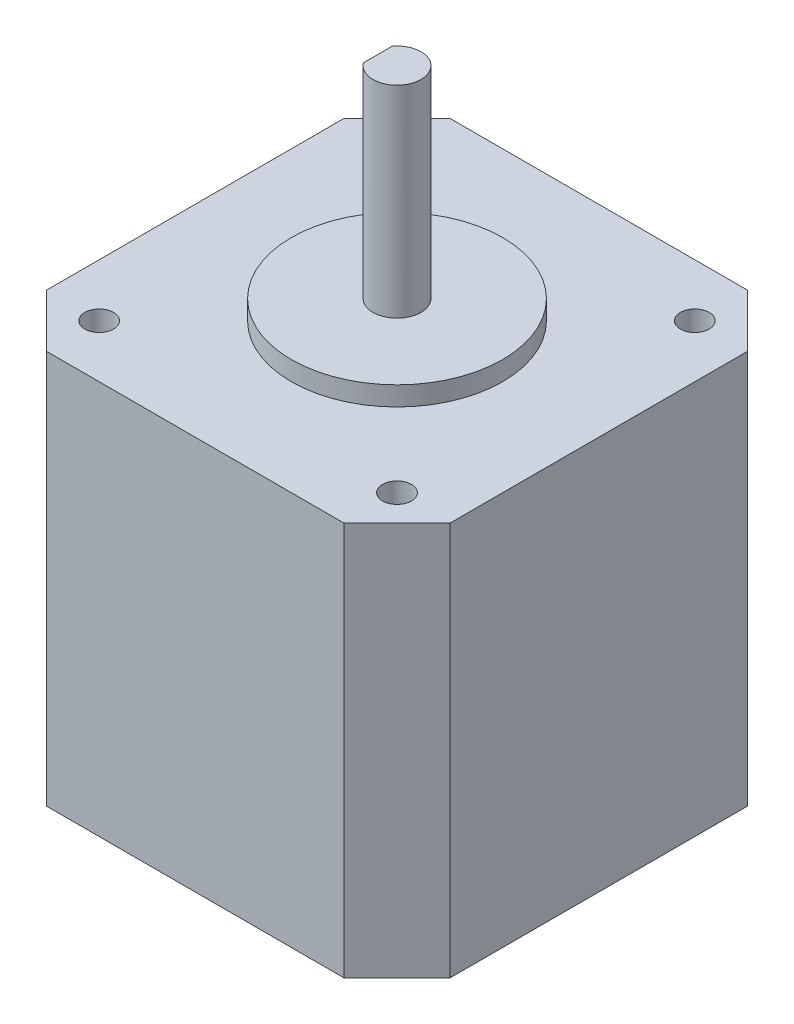
ISO-10303-21;
HEADER;
FILE_DESCRIPTION(('STEP AP214'),'2;1');
FILE_NAME('part.step','',(''),(''),'','','');
FILE_SCHEMA(('AUTOMOTIVE_DESIGN { 1 0 10303 214 1 1 1 1 }'));
ENDSEC;
DATA;
#1=APPLICATION_CONTEXT('core data for automotive mechanical design processes');
#2=APPLICATION_PROTOCOL_DEFINITION('international standard','automotive_design',2000,#1);
#3=PRODUCT_CONTEXT('',#1,'mechanical');
#4=PRODUCT('Part','Part','',(#3));
#5=PRODUCT_RELATED_PRODUCT_CATEGORY('part','',(#4));
#6=PRODUCT_DEFINITION_FORMATION('','',#4);
#7=PRODUCT_DEFINITION_CONTEXT('part definition',#1,'design');
#8=PRODUCT_DEFINITION('design','',#6,#7);
#9=PRODUCT_DEFINITION_SHAPE('','',#8);
#10=(LENGTH_UNIT() NAMED_UNIT(*) SI_UNIT(.MILLI.,.METRE.));
#11=(NAMED_UNIT(*) PLANE_ANGLE_UNIT() SI_UNIT($,.RADIAN.));
#12=(NAMED_UNIT(*) SI_UNIT($,.STERADIAN.) SOLID_ANGLE_UNIT());
#13=UNCERTAINTY_MEASURE_WITH_UNIT(LENGTH_MEASURE(1.E-05),#10,'distance_accuracy_value','');
#14=(GEOMETRIC_REPRESENTATION_CONTEXT(3) GLOBAL_UNCERTAINTY_ASSIGNED_CONTEXT((#13)) GLOBAL_UNIT_ASSIGNED_CONTEXT((#10,
#11,#12)) REPRESENTATION_CONTEXT('',''));
#15=CARTESIAN_POINT('',(0.,0.,0.));
#16=DIRECTION('',(0.,0.,1.));
#17=DIRECTION('',(1.,0.,0.));
#18=AXIS2_PLACEMENT_3D('',#15,#16,#17);
#19=CARTESIAN_POINT('',(-20.9999999999999,11.5,15.5000000000004));
#20=DIRECTION('',(0.707106781186548,0.,-0.707106781186548));
#21=DIRECTION('',(-0.707106781186548,0.,-0.707106781186548));
#22=AXIS2_PLACEMENT_3D('',#19,#20,#21);
#23=PLANE('',#22);
#24=DIRECTION('',(0.,-1.,0.));
#25=VECTOR('',#24,1.);
#26=CARTESIAN_POINT('',(-20.9999999999999,11.5,15.5000000000004));
#27=LINE('',#26,#25);
#28=CARTESIAN_POINT('',(-20.9999999999999,19.5,15.5000000000004));
#29=VERTEX_POINT('',#28);
#30=CARTESIAN_POINT('',(-20.9999999999999,-21.5,15.5000000000004));
#31=VERTEX_POINT('',#30);
#32=EDGE_CURVE('E210',#29,#31,#27,.T.);
#33=ORIENTED_EDGE('',*,*,#32,.T.);
#34=DIRECTION('',(-0.707106781186548,0.,-0.707106781186548));
#35=VECTOR('',#34,1.);
#36=CARTESIAN_POINT('',(-18.2500000000002,-21.5,18.2500000000002));
#37=LINE('',#36,#35);
#38=CARTESIAN_POINT('',(-15.5000000000001,-21.5,21.0000000000002));
#39=VERTEX_POINT('',#38);
#40=EDGE_CURVE('E190',#39,#31,#37,.T.);
#41=ORIENTED_EDGE('',*,*,#40,.F.);
#42=DIRECTION('',(0.,-1.,0.));
#43=VECTOR('',#42,1.);
#44=CARTESIAN_POINT('',(-15.5000000000001,11.5,21.0000000000002));
#45=LINE('',#44,#43);
#46=CARTESIAN_POINT('',(-15.5000000000001,19.5,21.0000000000002));
#47=VERTEX_POINT('',#46);
#48=EDGE_CURVE('E37',#47,#39,#45,.T.);
#49=ORIENTED_EDGE('',*,*,#48,.F.);
#50=DIRECTION('',(0.707106781186547,0.,0.707106781186547));
#51=VECTOR('',#50,1.);
#52=CARTESIAN_POINT('',(-20.9999999999999,19.5,15.5000000000004));
#53=LINE('',#52,#51);
#54=EDGE_CURVE('E161',#29,#47,#53,.T.);
#55=ORIENTED_EDGE('',*,*,#54,.F.);
#56=EDGE_LOOP('',(#33,#41,#49,#55));
#57=FACE_BOUND('',#56,.T.);
#58=ADVANCED_FACE('F34',(#57),#23,.F.);
#59=CARTESIAN_POINT('',(-15.5000000000001,11.5,21.0000000000002));
#60=DIRECTION('',(0.,0.,-1.));
#61=DIRECTION('',(-1.,0.,0.));
#62=AXIS2_PLACEMENT_3D('',#59,#60,#61);
#63=PLANE('',#62);
#64=ORIENTED_EDGE('',*,*,#48,.T.);
#65=DIRECTION('',(-1.,0.,0.));
#66=VECTOR('',#65,1.);
#67=CARTESIAN_POINT('',(0.,-21.5,21.0000000000002));
#68=LINE('',#67,#66);
#69=CARTESIAN_POINT('',(15.5000000000003,-21.5,21.0000000000002));
#70=VERTEX_POINT('',#69);
#71=EDGE_CURVE('E187',#70,#39,#68,.T.);
#72=ORIENTED_EDGE('',*,*,#71,.F.);
#73=DIRECTION('',(0.,-1.,0.));
#74=VECTOR('',#73,1.);
#75=CARTESIAN_POINT('',(15.5000000000003,11.5,21.0000000000002));
#76=LINE('',#75,#74);
#77=CARTESIAN_POINT('',(15.5000000000003,19.5,21.0000000000002));
#78=VERTEX_POINT('',#77);
#79=EDGE_CURVE('E57',#78,#70,#76,.T.);
#80=ORIENTED_EDGE('',*,*,#79,.F.);
#81=DIRECTION('',(1.,0.,0.));
#82=VECTOR('',#81,1.);
#83=CARTESIAN_POINT('',(-15.5000000000001,19.5,21.0000000000002));
#84=LINE('',#83,#82);
#85=EDGE_CURVE('E166',#47,#78,#84,.T.);
#86=ORIENTED_EDGE('',*,*,#85,.F.);
#87=EDGE_LOOP('',(#64,#72,#80,#86));
#88=FACE_BOUND('',#87,.T.);
#89=ADVANCED_FACE('F225',(#88),#63,.F.);
#90=CARTESIAN_POINT('',(15.5000000000003,11.5,21.0000000000002));
#91=DIRECTION('',(-0.707106781186555,0.,-0.70710678118654));
#92=DIRECTION('',(-0.70710678118654,0.,0.707106781186555));
#93=AXIS2_PLACEMENT_3D('',#90,#91,#92);
#94=PLANE('',#93);
#95=ORIENTED_EDGE('',*,*,#79,.T.);
#96=DIRECTION('',(-0.70710678118654,0.,0.707106781186555));
#97=VECTOR('',#96,1.);
#98=CARTESIAN_POINT('',(18.2500000000004,-21.5,18.2500000000001));
#99=LINE('',#98,#97);
#100=CARTESIAN_POINT('',(20.9999999999997,-21.5,15.5000000000007));
#101=VERTEX_POINT('',#100);
#102=EDGE_CURVE('E208',#101,#70,#99,.T.);
#103=ORIENTED_EDGE('',*,*,#102,.F.);
#104=DIRECTION('',(0.,-1.,0.));
#105=VECTOR('',#104,1.);
#106=CARTESIAN_POINT('',(20.9999999999997,11.5,15.5000000000007));
#107=LINE('',#106,#105);
#108=CARTESIAN_POINT('',(20.9999999999997,19.5,15.5000000000007));
#109=VERTEX_POINT('',#108);
#110=EDGE_CURVE('E220',#109,#101,#107,.T.);
#111=ORIENTED_EDGE('',*,*,#110,.F.);
#112=DIRECTION('',(0.70710678118654,0.,-0.707106781186555));
#113=VECTOR('',#112,1.);
#114=CARTESIAN_POINT('',(15.5000000000003,19.5,21.0000000000002));
#115=LINE('',#114,#113);
#116=EDGE_CURVE('E169',#78,#109,#115,.T.);
#117=ORIENTED_EDGE('',*,*,#116,.F.);
#118=EDGE_LOOP('',(#95,#103,#111,#117));
#119=FACE_BOUND('',#118,.T.);
#120=ADVANCED_FACE('F232',(#119),#94,.F.);
#121=CARTESIAN_POINT('',(20.9999999999997,11.5,-15.5000000000003));
#122=DIRECTION('',(-1.,0.,0.));
#123=DIRECTION('',(0.,0.,1.));
#124=AXIS2_PLACEMENT_3D('',#121,#122,#123);
#125=PLANE('',#124);
#126=ORIENTED_EDGE('',*,*,#110,.T.);
#127=DIRECTION('',(0.,0.,1.));
#128=VECTOR('',#127,1.);
#129=CARTESIAN_POINT('',(20.9999999999997,-21.5,0.));
#130=LINE('',#129,#128);
#131=CARTESIAN_POINT('',(20.9999999999997,-21.5,-15.5000000000003));
#132=VERTEX_POINT('',#131);
#133=EDGE_CURVE('E205',#132,#101,#130,.T.);
#134=ORIENTED_EDGE('',*,*,#133,.F.);
#135=DIRECTION('',(0.,-1.,0.));
#136=VECTOR('',#135,1.);
#137=CARTESIAN_POINT('',(20.9999999999997,11.5,-15.5000000000003));
#138=LINE('',#137,#136);
#139=CARTESIAN_POINT('',(20.9999999999997,19.5,-15.5000000000003));
#140=VERTEX_POINT('',#139);
#141=EDGE_CURVE('E218',#140,#132,#138,.T.);
#142=ORIENTED_EDGE('',*,*,#141,.F.);
#143=DIRECTION('',(0.,0.,-1.));
#144=VECTOR('',#143,1.);
#145=CARTESIAN_POINT('',(20.9999999999997,19.5,-15.5000000000003));
#146=LINE('',#145,#144);
#147=EDGE_CURVE('E172',#109,#140,#146,.T.);
#148=ORIENTED_EDGE('',*,*,#147,.F.);
#149=EDGE_LOOP('',(#126,#134,#142,#148));
#150=FACE_BOUND('',#149,.T.);
#151=ADVANCED_FACE('F239',(#150),#125,.F.);
#152=CARTESIAN_POINT('',(15.5000000000003,11.5,-20.9999999999998));
#153=DIRECTION('',(-0.707106781186555,0.,0.70710678118654));
#154=DIRECTION('',(0.70710678118654,0.,0.707106781186555));
#155=AXIS2_PLACEMENT_3D('',#152,#153,#154);
#156=PLANE('',#155);
#157=ORIENTED_EDGE('',*,*,#141,.T.);
#158=DIRECTION('',(0.70710678118654,0.,0.707106781186555));
#159=VECTOR('',#158,1.);
#160=CARTESIAN_POINT('',(18.2500000000002,-21.5,-18.2499999999998));
#161=LINE('',#160,#159);
#162=CARTESIAN_POINT('',(15.5000000000003,-21.5,-20.9999999999998));
#163=VERTEX_POINT('',#162);
#164=EDGE_CURVE('E202',#163,#132,#161,.T.);
#165=ORIENTED_EDGE('',*,*,#164,.F.);
#166=DIRECTION('',(0.,-1.,0.));
#167=VECTOR('',#166,1.);
#168=CARTESIAN_POINT('',(15.5000000000003,11.5,-20.9999999999998));
#169=LINE('',#168,#167);
#170=CARTESIAN_POINT('',(15.5000000000003,19.5,-20.9999999999998));
#171=VERTEX_POINT('',#170);
#172=EDGE_CURVE('E216',#171,#163,#169,.T.);
#173=ORIENTED_EDGE('',*,*,#172,.F.);
#174=DIRECTION('',(-0.70710678118654,0.,-0.707106781186555));
#175=VECTOR('',#174,1.);
#176=CARTESIAN_POINT('',(15.5000000000003,19.5,-20.9999999999998));
#177=LINE('',#176,#175);
#178=EDGE_CURVE('E175',#140,#171,#177,.T.);
#179=ORIENTED_EDGE('',*,*,#178,.F.);
#180=EDGE_LOOP('',(#157,#165,#173,#179));
#181=FACE_BOUND('',#180,.T.);
#182=ADVANCED_FACE('F242',(#181),#156,.F.);
#183=CARTESIAN_POINT('',(-15.5000000000001,11.5,-20.9999999999998));
#184=DIRECTION('',(0.,0.,1.));
#185=DIRECTION('',(1.,0.,0.));
#186=AXIS2_PLACEMENT_3D('',#183,#184,#185);
#187=PLANE('',#186);
#188=ORIENTED_EDGE('',*,*,#172,.T.);
#189=DIRECTION('',(1.,0.,0.));
#190=VECTOR('',#189,1.);
#191=CARTESIAN_POINT('',(0.,-21.5,-20.9999999999998));
#192=LINE('',#191,#190);
#193=CARTESIAN_POINT('',(-15.5000000000001,-21.5,-20.9999999999998));
#194=VERTEX_POINT('',#193);
#195=EDGE_CURVE('E199',#194,#163,#192,.T.);
#196=ORIENTED_EDGE('',*,*,#195,.F.);
#197=DIRECTION('',(0.,-1.,0.));
#198=VECTOR('',#197,1.);
#199=CARTESIAN_POINT('',(-15.5000000000001,11.5,-20.9999999999998));
#200=LINE('',#199,#198);
#201=CARTESIAN_POINT('',(-15.5000000000001,19.5,-20.9999999999998));
#202=VERTEX_POINT('',#201);
#203=EDGE_CURVE('E214',#202,#194,#200,.T.);
#204=ORIENTED_EDGE('',*,*,#203,.F.);
#205=DIRECTION('',(-1.,0.,0.));
#206=VECTOR('',#205,1.);
#207=CARTESIAN_POINT('',(-15.5000000000001,19.5,-20.9999999999998));
#208=LINE('',#207,#206);
#209=EDGE_CURVE('E178',#171,#202,#208,.T.);
#210=ORIENTED_EDGE('',*,*,#209,.F.);
#211=EDGE_LOOP('',(#188,#196,#204,#210));
#212=FACE_BOUND('',#211,.T.);
#213=ADVANCED_FACE('F246',(#212),#187,.F.);
#214=CARTESIAN_POINT('',(-15.5000000000001,11.5,-20.9999999999998));
#215=DIRECTION('',(0.707106781186548,0.,0.707106781186548));
#216=DIRECTION('',(0.707106781186548,0.,-0.707106781186548));
#217=AXIS2_PLACEMENT_3D('',#214,#215,#216);
#218=PLANE('',#217);
#219=ORIENTED_EDGE('',*,*,#203,.T.);
#220=DIRECTION('',(0.707106781186548,0.,-0.707106781186548));
#221=VECTOR('',#220,1.);
#222=CARTESIAN_POINT('',(-18.2499999999999,-21.5,-18.2499999999999));
#223=LINE('',#222,#221);
#224=CARTESIAN_POINT('',(-20.9999999999999,-21.5,-15.5));
#225=VERTEX_POINT('',#224);
#226=EDGE_CURVE('E196',#225,#194,#223,.T.);
#227=ORIENTED_EDGE('',*,*,#226,.F.);
#228=DIRECTION('',(0.,-1.,0.));
#229=VECTOR('',#228,1.);
#230=CARTESIAN_POINT('',(-20.9999999999999,11.5,-15.5));
#231=LINE('',#230,#229);
#232=CARTESIAN_POINT('',(-20.9999999999999,19.5,-15.5));
#233=VERTEX_POINT('',#232);
#234=EDGE_CURVE('E212',#233,#225,#231,.T.);
#235=ORIENTED_EDGE('',*,*,#234,.F.);
#236=DIRECTION('',(-0.707106781186547,0.,0.707106781186547));
#237=VECTOR('',#236,1.);
#238=CARTESIAN_POINT('',(-15.5000000000001,19.5,-20.9999999999998));
#239=LINE('',#238,#237);
#240=EDGE_CURVE('E181',#202,#233,#239,.T.);
#241=ORIENTED_EDGE('',*,*,#240,.F.);
#242=EDGE_LOOP('',(#219,#227,#235,#241));
#243=FACE_BOUND('',#242,.T.);
#244=ADVANCED_FACE('F251',(#243),#218,.F.);
#245=CARTESIAN_POINT('',(-20.9999999999999,11.5,-15.5));
#246=DIRECTION('',(1.,0.,0.));
#247=DIRECTION('',(0.,0.,-1.));
#248=AXIS2_PLACEMENT_3D('',#245,#246,#247);
#249=PLANE('',#248);
#250=ORIENTED_EDGE('',*,*,#234,.T.);
#251=DIRECTION('',(0.,0.,-1.));
#252=VECTOR('',#251,1.);
#253=CARTESIAN_POINT('',(-20.9999999999999,-21.5,0.));
#254=LINE('',#253,#252);
#255=EDGE_CURVE('E193',#31,#225,#254,.T.);
#256=ORIENTED_EDGE('',*,*,#255,.F.);
#257=ORIENTED_EDGE('',*,*,#32,.F.);
#258=DIRECTION('',(0.,0.,1.));
#259=VECTOR('',#258,1.);
#260=CARTESIAN_POINT('',(-20.9999999999999,19.5,-15.5));
#261=LINE('',#260,#259);
#262=EDGE_CURVE('E184',#233,#29,#261,.T.);
#263=ORIENTED_EDGE('',*,*,#262,.F.);
#264=EDGE_LOOP('',(#250,#256,#257,#263));
#265=FACE_BOUND('',#264,.T.);
#266=ADVANCED_FACE('F253',(#265),#249,.F.);
#267=CARTESIAN_POINT('',(0.,-21.5,0.));
#268=DIRECTION('',(0.,-1.,0.));
#269=DIRECTION('',(0.,0.,-1.));
#270=AXIS2_PLACEMENT_3D('',#267,#268,#269);
#271=PLANE('',#270);
#272=ORIENTED_EDGE('',*,*,#71,.T.);
#273=ORIENTED_EDGE('',*,*,#40,.T.);
#274=ORIENTED_EDGE('',*,*,#255,.T.);
#275=ORIENTED_EDGE('',*,*,#226,.T.);
#276=ORIENTED_EDGE('',*,*,#195,.T.);
#277=ORIENTED_EDGE('',*,*,#164,.T.);
#278=ORIENTED_EDGE('',*,*,#133,.T.);
#279=ORIENTED_EDGE('',*,*,#102,.T.);
#280=EDGE_LOOP('',(#272,#273,#274,#275,#276,#277,#278,#279));
#281=FACE_BOUND('',#280,.T.);
#282=ADVANCED_FACE('F230',(#281),#271,.T.);
#283=CARTESIAN_POINT('',(0.,19.5,0.));
#284=DIRECTION('',(0.,1.,0.));
#285=DIRECTION('',(0.,0.,1.));
#286=AXIS2_PLACEMENT_3D('',#283,#284,#285);
#287=PLANE('',#286);
#288=CARTESIAN_POINT('',(0.,19.5,0.));
#289=DIRECTION('',(0.,1.,0.));
#290=DIRECTION('',(0.,0.,1.));
#291=AXIS2_PLACEMENT_3D('',#288,#289,#290);
#292=CIRCLE('',#291,11.);
#293=CARTESIAN_POINT('',(0.,19.5,11.));
#294=VERTEX_POINT('',#293);
#295=EDGE_CURVE('E132',#294,#294,#292,.T.);
#296=ORIENTED_EDGE('',*,*,#295,.F.);
#297=EDGE_LOOP('',(#296));
#298=FACE_BOUND('',#297,.T.);
#299=CARTESIAN_POINT('',(-15.5000000000001,19.5,15.5000000000001));
#300=DIRECTION('',(0.,1.,0.));
#301=DIRECTION('',(0.,0.,1.));
#302=AXIS2_PLACEMENT_3D('',#299,#300,#301);
#303=CIRCLE('',#302,1.50000000000006);
#304=CARTESIAN_POINT('',(-15.5000000000001,19.5,17.0000000000001));
#305=VERTEX_POINT('',#304);
#306=EDGE_CURVE('E146',#305,#305,#303,.T.);
#307=ORIENTED_EDGE('',*,*,#306,.F.);
#308=EDGE_LOOP('',(#307));
#309=FACE_BOUND('',#308,.T.);
#310=CARTESIAN_POINT('',(-15.5000000000001,19.5,-15.5000000000001));
#311=DIRECTION('',(0.,1.,0.));
#312=DIRECTION('',(0.,0.,1.));
#313=AXIS2_PLACEMENT_3D('',#310,#311,#312);
#314=CIRCLE('',#313,1.50000000000006);
#315=CARTESIAN_POINT('',(-15.5000000000001,19.5,-14.));
#316=VERTEX_POINT('',#315);
#317=EDGE_CURVE('E158',#316,#316,#314,.T.);
#318=ORIENTED_EDGE('',*,*,#317,.F.);
#319=EDGE_LOOP('',(#318));
#320=FACE_BOUND('',#319,.T.);
#321=ORIENTED_EDGE('',*,*,#54,.T.);
#322=ORIENTED_EDGE('',*,*,#85,.T.);
#323=ORIENTED_EDGE('',*,*,#116,.T.);
#324=ORIENTED_EDGE('',*,*,#147,.T.);
#325=ORIENTED_EDGE('',*,*,#178,.T.);
#326=ORIENTED_EDGE('',*,*,#209,.T.);
#327=ORIENTED_EDGE('',*,*,#240,.T.);
#328=ORIENTED_EDGE('',*,*,#262,.T.);
#329=EDGE_LOOP('',(#321,#322,#323,#324,#325,#326,#327,#328));
#330=FACE_BOUND('',#329,.T.);
#331=CARTESIAN_POINT('',(15.5000000000001,19.5,-15.5000000000001));
#332=DIRECTION('',(0.,1.,0.));
#333=DIRECTION('',(0.,0.,1.));
#334=AXIS2_PLACEMENT_3D('',#331,#332,#333);
#335=CIRCLE('',#334,1.50000000000006);
#336=CARTESIAN_POINT('',(15.5000000000001,19.5,-14.));
#337=VERTEX_POINT('',#336);
#338=EDGE_CURVE('E152',#337,#337,#335,.T.);
#339=ORIENTED_EDGE('',*,*,#338,.F.);
#340=EDGE_LOOP('',(#339));
#341=FACE_BOUND('',#340,.T.);
#342=CARTESIAN_POINT('',(15.5000000000001,19.5,15.5000000000001));
#343=DIRECTION('',(0.,1.,0.));
#344=DIRECTION('',(0.,0.,1.));
#345=AXIS2_PLACEMENT_3D('',#342,#343,#344);
#346=CIRCLE('',#345,1.50000000000006);
#347=CARTESIAN_POINT('',(15.5000000000001,19.5,17.0000000000001));
#348=VERTEX_POINT('',#347);
#349=EDGE_CURVE('E140',#348,#348,#346,.T.);
#350=ORIENTED_EDGE('',*,*,#349,.F.);
#351=EDGE_LOOP('',(#350));
#352=FACE_BOUND('',#351,.T.);
#353=ADVANCED_FACE('F236',(#298,#309,#320,#330,#341,#352),#287,.T.);
#354=CARTESIAN_POINT('',(-15.5000000000001,19.5,-15.5000000000001));
#355=DIRECTION('',(0.,-1.,0.));
#356=DIRECTION('',(0.,0.,-1.));
#357=AXIS2_PLACEMENT_3D('',#354,#355,#356);
#358=CYLINDRICAL_SURFACE('',#357,1.50000000000006);
#359=ORIENTED_EDGE('',*,*,#317,.T.);
#360=EDGE_LOOP('',(#359));
#361=FACE_BOUND('',#360,.T.);
#362=CARTESIAN_POINT('',(-15.5000000000001,11.5,-15.5000000000001));
#363=DIRECTION('',(0.,1.,0.));
#364=DIRECTION('',(0.,0.,1.));
#365=AXIS2_PLACEMENT_3D('',#362,#363,#364);
#366=CIRCLE('',#365,1.50000000000006);
#367=CARTESIAN_POINT('',(-15.5000000000001,11.5,-14.));
#368=VERTEX_POINT('',#367);
#369=EDGE_CURVE('E155',#368,#368,#366,.T.);
#370=ORIENTED_EDGE('',*,*,#369,.F.);
#371=EDGE_LOOP('',(#370));
#372=FACE_BOUND('',#371,.T.);
#373=ADVANCED_FACE('F297',(#361,#372),#358,.F.);
#374=CARTESIAN_POINT('',(15.5000000000001,19.5,-15.5000000000001));
#375=DIRECTION('',(0.,-1.,0.));
#376=DIRECTION('',(0.,0.,-1.));
#377=AXIS2_PLACEMENT_3D('',#374,#375,#376);
#378=CYLINDRICAL_SURFACE('',#377,1.50000000000006);
#379=ORIENTED_EDGE('',*,*,#338,.T.);
#380=EDGE_LOOP('',(#379));
#381=FACE_BOUND('',#380,.T.);
#382=CARTESIAN_POINT('',(15.5000000000001,11.5,-15.5000000000001));
#383=DIRECTION('',(0.,1.,0.));
#384=DIRECTION('',(0.,0.,1.));
#385=AXIS2_PLACEMENT_3D('',#382,#383,#384);
#386=CIRCLE('',#385,1.50000000000006);
#387=CARTESIAN_POINT('',(15.5000000000001,11.5,-14.));
#388=VERTEX_POINT('',#387);
#389=EDGE_CURVE('E149',#388,#388,#386,.T.);
#390=ORIENTED_EDGE('',*,*,#389,.F.);
#391=EDGE_LOOP('',(#390));
#392=FACE_BOUND('',#391,.T.);
#393=ADVANCED_FACE('F302',(#381,#392),#378,.F.);
#394=CARTESIAN_POINT('',(-15.5000000000001,19.5,15.5000000000001));
#395=DIRECTION('',(0.,-1.,0.));
#396=DIRECTION('',(0.,0.,-1.));
#397=AXIS2_PLACEMENT_3D('',#394,#395,#396);
#398=CYLINDRICAL_SURFACE('',#397,1.50000000000006);
#399=ORIENTED_EDGE('',*,*,#306,.T.);
#400=EDGE_LOOP('',(#399));
#401=FACE_BOUND('',#400,.T.);
#402=CARTESIAN_POINT('',(-15.5000000000001,11.5,15.5000000000001));
#403=DIRECTION('',(0.,1.,0.));
#404=DIRECTION('',(0.,0.,1.));
#405=AXIS2_PLACEMENT_3D('',#402,#403,#404);
#406=CIRCLE('',#405,1.50000000000006);
#407=CARTESIAN_POINT('',(-15.5000000000001,11.5,17.0000000000001));
#408=VERTEX_POINT('',#407);
#409=EDGE_CURVE('E143',#408,#408,#406,.T.);
#410=ORIENTED_EDGE('',*,*,#409,.F.);
#411=EDGE_LOOP('',(#410));
#412=FACE_BOUND('',#411,.T.);
#413=ADVANCED_FACE('F313',(#401,#412),#398,.F.);
#414=CARTESIAN_POINT('',(15.5000000000001,19.5,15.5000000000001));
#415=DIRECTION('',(0.,-1.,0.));
#416=DIRECTION('',(0.,0.,-1.));
#417=AXIS2_PLACEMENT_3D('',#414,#415,#416);
#418=CYLINDRICAL_SURFACE('',#417,1.50000000000006);
#419=ORIENTED_EDGE('',*,*,#349,.T.);
#420=EDGE_LOOP('',(#419));
#421=FACE_BOUND('',#420,.T.);
#422=CARTESIAN_POINT('',(15.5000000000001,11.5,15.5000000000001));
#423=DIRECTION('',(0.,1.,0.));
#424=DIRECTION('',(0.,0.,1.));
#425=AXIS2_PLACEMENT_3D('',#422,#423,#424);
#426=CIRCLE('',#425,1.50000000000006);
#427=CARTESIAN_POINT('',(15.5000000000001,11.5,17.0000000000001));
#428=VERTEX_POINT('',#427);
#429=EDGE_CURVE('E137',#428,#428,#426,.T.);
#430=ORIENTED_EDGE('',*,*,#429,.F.);
#431=EDGE_LOOP('',(#430));
#432=FACE_BOUND('',#431,.T.);
#433=ADVANCED_FACE('F323',(#421,#432),#418,.F.);
#434=CARTESIAN_POINT('',(0.,11.5,0.));
#435=DIRECTION('',(0.,1.,0.));
#436=DIRECTION('',(0.,0.,1.));
#437=AXIS2_PLACEMENT_3D('',#434,#435,#436);
#438=PLANE('',#437);
#439=ORIENTED_EDGE('',*,*,#409,.T.);
#440=EDGE_LOOP('',(#439));
#441=FACE_BOUND('',#440,.T.);
#442=ADVANCED_FACE('F333',(#441),#438,.T.);
#443=ORIENTED_EDGE('',*,*,#389,.T.);
#444=EDGE_LOOP('',(#443));
#445=FACE_BOUND('',#444,.T.);
#446=ADVANCED_FACE('F344',(#445),#438,.T.);
#447=ORIENTED_EDGE('',*,*,#369,.T.);
#448=EDGE_LOOP('',(#447));
#449=FACE_BOUND('',#448,.T.);
#450=ADVANCED_FACE('F355',(#449),#438,.T.);
#451=ORIENTED_EDGE('',*,*,#429,.T.);
#452=EDGE_LOOP('',(#451));
#453=FACE_BOUND('',#452,.T.);
#454=ADVANCED_FACE('F346',(#453),#438,.T.);
#455=CARTESIAN_POINT('',(0.,21.5,0.));
#456=DIRECTION('',(0.,-1.,0.));
#457=DIRECTION('',(0.,0.,-1.));
#458=AXIS2_PLACEMENT_3D('',#455,#456,#457);
#459=CYLINDRICAL_SURFACE('',#458,11.);
#460=CARTESIAN_POINT('',(0.,21.5,0.));
#461=DIRECTION('',(0.,1.,0.));
#462=DIRECTION('',(0.,0.,1.));
#463=AXIS2_PLACEMENT_3D('',#460,#461,#462);
#464=CIRCLE('',#463,11.);
#465=CARTESIAN_POINT('',(0.,21.5,11.));
#466=VERTEX_POINT('',#465);
#467=EDGE_CURVE('E134',#466,#466,#464,.T.);
#468=ORIENTED_EDGE('',*,*,#467,.F.);
#469=EDGE_LOOP('',(#468));
#470=FACE_BOUND('',#469,.T.);
#471=ORIENTED_EDGE('',*,*,#295,.T.);
#472=EDGE_LOOP('',(#471));
#473=FACE_BOUND('',#472,.T.);
#474=ADVANCED_FACE('F372',(#470,#473),#459,.T.);
#475=CARTESIAN_POINT('',(0.,21.5,0.));
#476=DIRECTION('',(0.,1.,0.));
#477=DIRECTION('',(0.,0.,1.));
#478=AXIS2_PLACEMENT_3D('',#475,#476,#477);
#479=PLANE('',#478);
#480=CARTESIAN_POINT('',(0.,21.5,0.));
#481=DIRECTION('',(0.,1.,0.));
#482=DIRECTION('',(0.,0.,1.));
#483=AXIS2_PLACEMENT_3D('',#480,#481,#482);
#484=CIRCLE('',#483,2.5);
#485=CARTESIAN_POINT('',(0.,21.5,2.5));
#486=VERTEX_POINT('',#485);
#487=EDGE_CURVE('E11',#486,#486,#484,.T.);
#488=ORIENTED_EDGE('',*,*,#487,.F.);
#489=EDGE_LOOP('',(#488));
#490=FACE_BOUND('',#489,.T.);
#491=ORIENTED_EDGE('',*,*,#467,.T.);
#492=EDGE_LOOP('',(#491));
#493=FACE_BOUND('',#492,.T.);
#494=ADVANCED_FACE('F388',(#490,#493),#479,.T.);
#495=CARTESIAN_POINT('',(0.,42.5,0.));
#496=DIRECTION('',(0.,-1.,0.));
#497=DIRECTION('',(0.,0.,-1.));
#498=AXIS2_PLACEMENT_3D('',#495,#496,#497);
#499=CYLINDRICAL_SURFACE('',#498,2.5);
#500=CARTESIAN_POINT('',(0.,42.5,0.));
#501=DIRECTION('',(0.,1.,0.));
#502=DIRECTION('',(0.,0.,1.));
#503=AXIS2_PLACEMENT_3D('',#500,#501,#502);
#504=CIRCLE('',#503,2.5);
#505=CARTESIAN_POINT('',(-2.,42.5,1.5));
#506=VERTEX_POINT('',#505);
#507=CARTESIAN_POINT('',(-2.,42.5,-1.50000000000006));
#508=VERTEX_POINT('',#507);
#509=EDGE_CURVE('E127',#506,#508,#504,.T.);
#510=ORIENTED_EDGE('',*,*,#509,.F.);
#511=DIRECTION('',(0.,1.,0.));
#512=VECTOR('',#511,1.);
#513=CARTESIAN_POINT('',(-2.,24.5,1.50000000000006));
#514=LINE('',#513,#512);
#515=CARTESIAN_POINT('',(-2.,24.5,1.50000000000006));
#516=VERTEX_POINT('',#515);
#517=EDGE_CURVE('E49',#516,#506,#514,.T.);
#518=ORIENTED_EDGE('',*,*,#517,.F.);
#519=CARTESIAN_POINT('',(0.,24.5,0.));
#520=DIRECTION('',(0.,1.,0.));
#521=DIRECTION('',(0.,0.,1.));
#522=AXIS2_PLACEMENT_3D('',#519,#520,#521);
#523=CIRCLE('',#522,2.50000000000004);
#524=CARTESIAN_POINT('',(-2.,24.5,-1.50000000000006));
#525=VERTEX_POINT('',#524);
#526=EDGE_CURVE('E113',#525,#516,#523,.T.);
#527=ORIENTED_EDGE('',*,*,#526,.F.);
#528=DIRECTION('',(0.,1.,0.));
#529=VECTOR('',#528,1.);
#530=CARTESIAN_POINT('',(-2.,24.5,-1.50000000000006));
#531=LINE('',#530,#529);
#532=EDGE_CURVE('E121',#525,#508,#531,.T.);
#533=ORIENTED_EDGE('',*,*,#532,.T.);
#534=EDGE_LOOP('',(#510,#518,#527,#533));
#535=FACE_BOUND('',#534,.T.);
#536=ORIENTED_EDGE('',*,*,#487,.T.);
#537=EDGE_LOOP('',(#536));
#538=FACE_BOUND('',#537,.T.);
#539=ADVANCED_FACE('F124',(#535,#538),#499,.T.);
#540=CARTESIAN_POINT('',(0.,42.5,0.));
#541=DIRECTION('',(0.,1.,0.));
#542=DIRECTION('',(0.,0.,1.));
#543=AXIS2_PLACEMENT_3D('',#540,#541,#542);
#544=PLANE('',#543);
#545=DIRECTION('',(0.,0.,-1.));
#546=VECTOR('',#545,1.);
#547=CARTESIAN_POINT('',(-2.,42.5,-1.50000000000006));
#548=LINE('',#547,#546);
#549=EDGE_CURVE('E118',#506,#508,#548,.T.);
#550=ORIENTED_EDGE('',*,*,#549,.F.);
#551=ORIENTED_EDGE('',*,*,#509,.T.);
#552=EDGE_LOOP('',(#550,#551));
#553=FACE_BOUND('',#552,.T.);
#554=ADVANCED_FACE('F407',(#553),#544,.T.);
#555=CARTESIAN_POINT('',(-2.,24.5,-1.50000000000006));
#556=DIRECTION('',(1.,0.,0.));
#557=DIRECTION('',(0.,0.,-1.));
#558=AXIS2_PLACEMENT_3D('',#555,#556,#557);
#559=PLANE('',#558);
#560=ORIENTED_EDGE('',*,*,#549,.T.);
#561=ORIENTED_EDGE('',*,*,#532,.F.);
#562=DIRECTION('',(0.,0.,-1.));
#563=VECTOR('',#562,1.);
#564=CARTESIAN_POINT('',(-2.,24.5,-1.50000000000006));
#565=LINE('',#564,#563);
#566=EDGE_CURVE('E115',#516,#525,#565,.T.);
#567=ORIENTED_EDGE('',*,*,#566,.F.);
#568=ORIENTED_EDGE('',*,*,#517,.T.);
#569=EDGE_LOOP('',(#560,#561,#567,#568));
#570=FACE_BOUND('',#569,.T.);
#571=ADVANCED_FACE('F120',(#570),#559,.F.);
#572=CARTESIAN_POINT('',(0.,24.5,0.));
#573=DIRECTION('',(0.,1.,0.));
#574=DIRECTION('',(0.,0.,1.));
#575=AXIS2_PLACEMENT_3D('',#572,#573,#574);
#576=PLANE('',#575);
#577=ORIENTED_EDGE('',*,*,#526,.T.);
#578=ORIENTED_EDGE('',*,*,#566,.T.);
#579=EDGE_LOOP('',(#577,#578));
#580=FACE_BOUND('',#579,.T.);
#581=ADVANCED_FACE('F114',(#580),#576,.T.);
#582=CLOSED_SHELL('',(#58,#89,#120,#151,#182,#213,#244,#266,#282,#353,#373,#393,#413,#433,#442,
#446,#450,#454,#474,#494,#539,#554,#571,#581));
#583=MANIFOLD_SOLID_BREP('B2',#582);
#584=ADVANCED_BREP_SHAPE_REPRESENTATION('',(#18,#583),#14);
#585=SHAPE_DEFINITION_REPRESENTATION(#9,#584);
ENDSEC;
END-ISO-10303-21;
